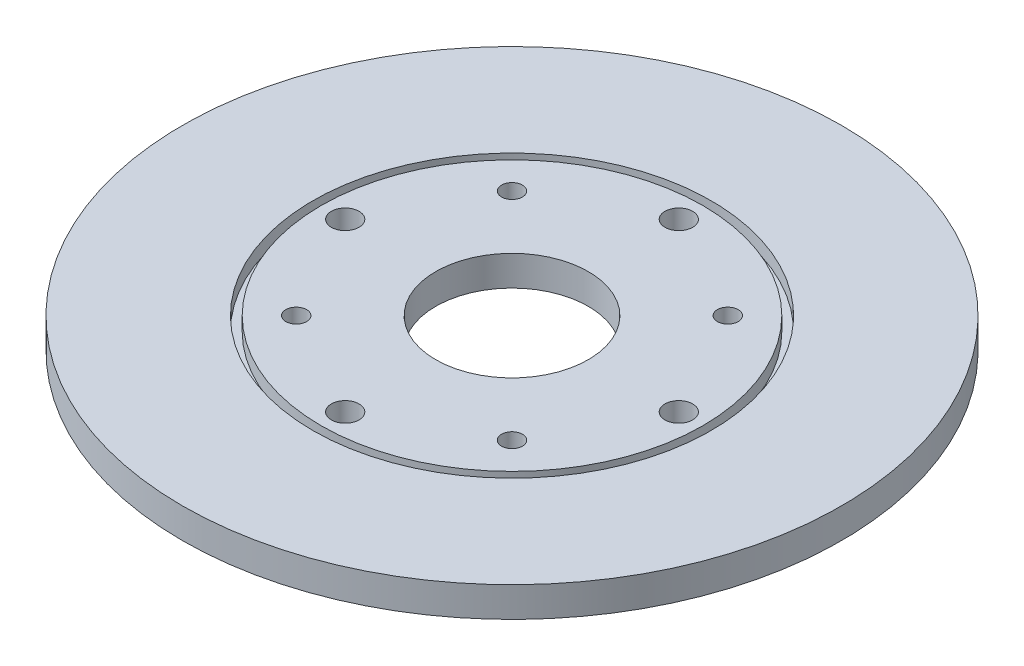
ISO-10303-21;
HEADER;
FILE_DESCRIPTION(('STEP AP214'),'2;1');
FILE_NAME('part.step','',(''),(''),'','','');
FILE_SCHEMA(('AUTOMOTIVE_DESIGN { 1 0 10303 214 1 1 1 1 }'));
ENDSEC;
DATA;
#1=APPLICATION_CONTEXT('core data for automotive mechanical design processes');
#2=APPLICATION_PROTOCOL_DEFINITION('international standard','automotive_design',2000,#1);
#3=PRODUCT_CONTEXT('',#1,'mechanical');
#4=PRODUCT('Part','Part','',(#3));
#5=PRODUCT_RELATED_PRODUCT_CATEGORY('part','',(#4));
#6=PRODUCT_DEFINITION_FORMATION('','',#4);
#7=PRODUCT_DEFINITION_CONTEXT('part definition',#1,'design');
#8=PRODUCT_DEFINITION('design','',#6,#7);
#9=PRODUCT_DEFINITION_SHAPE('','',#8);
#10=(LENGTH_UNIT() NAMED_UNIT(*) SI_UNIT(.MILLI.,.METRE.));
#11=(NAMED_UNIT(*) PLANE_ANGLE_UNIT() SI_UNIT($,.RADIAN.));
#12=(NAMED_UNIT(*) SI_UNIT($,.STERADIAN.) SOLID_ANGLE_UNIT());
#13=UNCERTAINTY_MEASURE_WITH_UNIT(LENGTH_MEASURE(1.E-05),#10,'distance_accuracy_value','');
#14=(GEOMETRIC_REPRESENTATION_CONTEXT(3) GLOBAL_UNCERTAINTY_ASSIGNED_CONTEXT((#13)) GLOBAL_UNIT_ASSIGNED_CONTEXT((#10,
#11,#12)) REPRESENTATION_CONTEXT('',''));
#15=CARTESIAN_POINT('',(0.,0.,0.));
#16=DIRECTION('',(0.,0.,1.));
#17=DIRECTION('',(1.,0.,0.));
#18=AXIS2_PLACEMENT_3D('',#15,#16,#17);
#19=CARTESIAN_POINT('',(0.,4.34,0.));
#20=DIRECTION('',(0.,1.,0.));
#21=DIRECTION('',(0.,0.,1.));
#22=AXIS2_PLACEMENT_3D('',#19,#20,#21);
#23=PLANE('',#22);
#24=CARTESIAN_POINT('',(0.,4.34,-24.0416305603426));
#25=DIRECTION('',(0.,1.,0.));
#26=DIRECTION('',(0.,0.,1.));
#27=AXIS2_PLACEMENT_3D('',#24,#25,#26);
#28=CIRCLE('',#27,2.);
#29=CARTESIAN_POINT('',(0.,4.34,-22.0416305603426));
#30=VERTEX_POINT('',#29);
#31=EDGE_CURVE('E106',#30,#30,#28,.T.);
#32=ORIENTED_EDGE('',*,*,#31,.F.);
#33=EDGE_LOOP('',(#32));
#34=FACE_BOUND('',#33,.T.);
#35=CARTESIAN_POINT('',(-24.0416305603426,4.34,0.));
#36=DIRECTION('',(0.,1.,0.));
#37=DIRECTION('',(0.,0.,1.));
#38=AXIS2_PLACEMENT_3D('',#35,#36,#37);
#39=CIRCLE('',#38,2.);
#40=CARTESIAN_POINT('',(-24.0416305603426,4.34,2.));
#41=VERTEX_POINT('',#40);
#42=EDGE_CURVE('E100',#41,#41,#39,.T.);
#43=ORIENTED_EDGE('',*,*,#42,.F.);
#44=EDGE_LOOP('',(#43));
#45=FACE_BOUND('',#44,.T.);
#46=CARTESIAN_POINT('',(0.,4.34,24.0416305603426));
#47=DIRECTION('',(0.,1.,0.));
#48=DIRECTION('',(0.,0.,1.));
#49=AXIS2_PLACEMENT_3D('',#46,#47,#48);
#50=CIRCLE('',#49,2.);
#51=CARTESIAN_POINT('',(0.,4.34,26.0416305603426));
#52=VERTEX_POINT('',#51);
#53=EDGE_CURVE('E94',#52,#52,#50,.T.);
#54=ORIENTED_EDGE('',*,*,#53,.F.);
#55=EDGE_LOOP('',(#54));
#56=FACE_BOUND('',#55,.T.);
#57=CARTESIAN_POINT('',(24.0416305603426,4.34,0.));
#58=DIRECTION('',(0.,1.,0.));
#59=DIRECTION('',(0.,0.,1.));
#60=AXIS2_PLACEMENT_3D('',#57,#58,#59);
#61=CIRCLE('',#60,2.);
#62=CARTESIAN_POINT('',(24.0416305603426,4.34,2.));
#63=VERTEX_POINT('',#62);
#64=EDGE_CURVE('E88',#63,#63,#61,.T.);
#65=ORIENTED_EDGE('',*,*,#64,.F.);
#66=EDGE_LOOP('',(#65));
#67=FACE_BOUND('',#66,.T.);
#68=CARTESIAN_POINT('',(-15.55,4.34,-15.55));
#69=DIRECTION('',(0.,1.,0.));
#70=DIRECTION('',(0.,0.,1.));
#71=AXIS2_PLACEMENT_3D('',#68,#69,#70);
#72=CIRCLE('',#71,1.5);
#73=CARTESIAN_POINT('',(-15.55,4.34,-14.05));
#74=VERTEX_POINT('',#73);
#75=EDGE_CURVE('E65',#74,#74,#72,.T.);
#76=ORIENTED_EDGE('',*,*,#75,.F.);
#77=EDGE_LOOP('',(#76));
#78=FACE_BOUND('',#77,.T.);
#79=CARTESIAN_POINT('',(15.55,4.34,15.55));
#80=DIRECTION('',(0.,1.,0.));
#81=DIRECTION('',(0.,0.,1.));
#82=AXIS2_PLACEMENT_3D('',#79,#80,#81);
#83=CIRCLE('',#82,1.5);
#84=CARTESIAN_POINT('',(15.55,4.34,17.05));
#85=VERTEX_POINT('',#84);
#86=EDGE_CURVE('E53',#85,#85,#83,.T.);
#87=ORIENTED_EDGE('',*,*,#86,.F.);
#88=EDGE_LOOP('',(#87));
#89=FACE_BOUND('',#88,.T.);
#90=CARTESIAN_POINT('',(0.,4.34,0.));
#91=DIRECTION('',(0.,1.,0.));
#92=DIRECTION('',(0.,0.,1.));
#93=AXIS2_PLACEMENT_3D('',#90,#91,#92);
#94=CIRCLE('',#93,11.);
#95=CARTESIAN_POINT('',(0.,4.34,11.));
#96=VERTEX_POINT('',#95);
#97=EDGE_CURVE('E42',#96,#96,#94,.T.);
#98=ORIENTED_EDGE('',*,*,#97,.F.);
#99=EDGE_LOOP('',(#98));
#100=FACE_BOUND('',#99,.T.);
#101=CARTESIAN_POINT('',(15.55,4.34,-15.55));
#102=DIRECTION('',(0.,1.,0.));
#103=DIRECTION('',(0.,0.,1.));
#104=AXIS2_PLACEMENT_3D('',#101,#102,#103);
#105=CIRCLE('',#104,1.5);
#106=CARTESIAN_POINT('',(15.55,4.34,-14.05));
#107=VERTEX_POINT('',#106);
#108=EDGE_CURVE('E47',#107,#107,#105,.T.);
#109=ORIENTED_EDGE('',*,*,#108,.F.);
#110=EDGE_LOOP('',(#109));
#111=FACE_BOUND('',#110,.T.);
#112=CARTESIAN_POINT('',(-15.55,4.34,15.55));
#113=DIRECTION('',(0.,1.,0.));
#114=DIRECTION('',(0.,0.,1.));
#115=AXIS2_PLACEMENT_3D('',#112,#113,#114);
#116=CIRCLE('',#115,1.5);
#117=CARTESIAN_POINT('',(-15.55,4.34,17.05));
#118=VERTEX_POINT('',#117);
#119=EDGE_CURVE('E59',#118,#118,#116,.T.);
#120=ORIENTED_EDGE('',*,*,#119,.F.);
#121=EDGE_LOOP('',(#120));
#122=FACE_BOUND('',#121,.T.);
#123=CARTESIAN_POINT('',(0.,4.34,0.));
#124=DIRECTION('',(0.,1.,0.));
#125=DIRECTION('',(0.,0.,1.));
#126=AXIS2_PLACEMENT_3D('',#123,#124,#125);
#127=CIRCLE('',#126,27.5);
#128=CARTESIAN_POINT('',(0.,4.34,27.5));
#129=VERTEX_POINT('',#128);
#130=EDGE_CURVE('E80',#129,#129,#127,.T.);
#131=ORIENTED_EDGE('',*,*,#130,.T.);
#132=EDGE_LOOP('',(#131));
#133=FACE_BOUND('',#132,.T.);
#134=ADVANCED_FACE('F31',(#34,#45,#56,#67,#78,#89,#100,#111,#122,#133),#23,.T.);
#135=CARTESIAN_POINT('',(0.,4.34,0.));
#136=DIRECTION('',(0.,1.,0.));
#137=DIRECTION('',(0.,0.,1.));
#138=AXIS2_PLACEMENT_3D('',#135,#136,#137);
#139=CIRCLE('',#138,28.7);
#140=CARTESIAN_POINT('',(0.,4.34,28.7));
#141=VERTEX_POINT('',#140);
#142=EDGE_CURVE('E74',#141,#141,#139,.T.);
#143=ORIENTED_EDGE('',*,*,#142,.F.);
#144=EDGE_LOOP('',(#143));
#145=FACE_BOUND('',#144,.T.);
#146=CARTESIAN_POINT('',(0.,4.34,0.));
#147=DIRECTION('',(0.,1.,0.));
#148=DIRECTION('',(0.,0.,1.));
#149=AXIS2_PLACEMENT_3D('',#146,#147,#148);
#150=CIRCLE('',#149,47.5);
#151=CARTESIAN_POINT('',(0.,4.34,47.5));
#152=VERTEX_POINT('',#151);
#153=EDGE_CURVE('E10',#152,#152,#150,.T.);
#154=ORIENTED_EDGE('',*,*,#153,.T.);
#155=EDGE_LOOP('',(#154));
#156=FACE_BOUND('',#155,.T.);
#157=ADVANCED_FACE('F115',(#145,#156),#23,.T.);
#158=CARTESIAN_POINT('',(0.,0.,0.));
#159=DIRECTION('',(0.,1.,0.));
#160=DIRECTION('',(0.,0.,1.));
#161=AXIS2_PLACEMENT_3D('',#158,#159,#160);
#162=PLANE('',#161);
#163=CARTESIAN_POINT('',(0.,0.,-24.0416305603426));
#164=DIRECTION('',(0.,1.,0.));
#165=DIRECTION('',(0.,0.,1.));
#166=AXIS2_PLACEMENT_3D('',#163,#164,#165);
#167=CIRCLE('',#166,2.);
#168=CARTESIAN_POINT('',(0.,0.,-22.0416305603426));
#169=VERTEX_POINT('',#168);
#170=EDGE_CURVE('E103',#169,#169,#167,.F.);
#171=ORIENTED_EDGE('',*,*,#170,.F.);
#172=EDGE_LOOP('',(#171));
#173=FACE_BOUND('',#172,.T.);
#174=CARTESIAN_POINT('',(-24.0416305603426,0.,0.));
#175=DIRECTION('',(0.,1.,0.));
#176=DIRECTION('',(0.,0.,1.));
#177=AXIS2_PLACEMENT_3D('',#174,#175,#176);
#178=CIRCLE('',#177,2.);
#179=CARTESIAN_POINT('',(-24.0416305603426,0.,2.));
#180=VERTEX_POINT('',#179);
#181=EDGE_CURVE('E97',#180,#180,#178,.F.);
#182=ORIENTED_EDGE('',*,*,#181,.F.);
#183=EDGE_LOOP('',(#182));
#184=FACE_BOUND('',#183,.T.);
#185=CARTESIAN_POINT('',(0.,0.,24.0416305603426));
#186=DIRECTION('',(0.,1.,0.));
#187=DIRECTION('',(0.,0.,1.));
#188=AXIS2_PLACEMENT_3D('',#185,#186,#187);
#189=CIRCLE('',#188,2.);
#190=CARTESIAN_POINT('',(0.,0.,26.0416305603426));
#191=VERTEX_POINT('',#190);
#192=EDGE_CURVE('E91',#191,#191,#189,.F.);
#193=ORIENTED_EDGE('',*,*,#192,.F.);
#194=EDGE_LOOP('',(#193));
#195=FACE_BOUND('',#194,.T.);
#196=CARTESIAN_POINT('',(24.0416305603426,0.,0.));
#197=DIRECTION('',(0.,1.,0.));
#198=DIRECTION('',(0.,0.,1.));
#199=AXIS2_PLACEMENT_3D('',#196,#197,#198);
#200=CIRCLE('',#199,2.);
#201=CARTESIAN_POINT('',(24.0416305603426,0.,2.));
#202=VERTEX_POINT('',#201);
#203=EDGE_CURVE('E83',#202,#202,#200,.F.);
#204=ORIENTED_EDGE('',*,*,#203,.F.);
#205=EDGE_LOOP('',(#204));
#206=FACE_BOUND('',#205,.T.);
#207=CARTESIAN_POINT('',(-15.55,0.,15.55));
#208=DIRECTION('',(0.,1.,0.));
#209=DIRECTION('',(0.,0.,1.));
#210=AXIS2_PLACEMENT_3D('',#207,#208,#209);
#211=CIRCLE('',#210,1.5);
#212=CARTESIAN_POINT('',(-15.55,0.,17.05));
#213=VERTEX_POINT('',#212);
#214=EDGE_CURVE('E62',#213,#213,#211,.T.);
#215=ORIENTED_EDGE('',*,*,#214,.T.);
#216=EDGE_LOOP('',(#215));
#217=FACE_BOUND('',#216,.T.);
#218=CARTESIAN_POINT('',(15.55,0.,-15.55));
#219=DIRECTION('',(0.,1.,0.));
#220=DIRECTION('',(0.,0.,1.));
#221=AXIS2_PLACEMENT_3D('',#218,#219,#220);
#222=CIRCLE('',#221,1.5);
#223=CARTESIAN_POINT('',(15.55,0.,-14.05));
#224=VERTEX_POINT('',#223);
#225=EDGE_CURVE('E50',#224,#224,#222,.T.);
#226=ORIENTED_EDGE('',*,*,#225,.T.);
#227=EDGE_LOOP('',(#226));
#228=FACE_BOUND('',#227,.T.);
#229=CARTESIAN_POINT('',(0.,0.,0.));
#230=DIRECTION('',(0.,1.,0.));
#231=DIRECTION('',(0.,0.,1.));
#232=AXIS2_PLACEMENT_3D('',#229,#230,#231);
#233=CIRCLE('',#232,47.5);
#234=CARTESIAN_POINT('',(0.,0.,47.5));
#235=VERTEX_POINT('',#234);
#236=EDGE_CURVE('E35',#235,#235,#233,.T.);
#237=ORIENTED_EDGE('',*,*,#236,.F.);
#238=EDGE_LOOP('',(#237));
#239=FACE_BOUND('',#238,.T.);
#240=CARTESIAN_POINT('',(0.,0.,0.));
#241=DIRECTION('',(0.,1.,0.));
#242=DIRECTION('',(0.,0.,1.));
#243=AXIS2_PLACEMENT_3D('',#240,#241,#242);
#244=CIRCLE('',#243,11.);
#245=CARTESIAN_POINT('',(0.,0.,11.));
#246=VERTEX_POINT('',#245);
#247=EDGE_CURVE('E44',#246,#246,#244,.T.);
#248=ORIENTED_EDGE('',*,*,#247,.T.);
#249=EDGE_LOOP('',(#248));
#250=FACE_BOUND('',#249,.T.);
#251=CARTESIAN_POINT('',(15.55,0.,15.55));
#252=DIRECTION('',(0.,1.,0.));
#253=DIRECTION('',(0.,0.,1.));
#254=AXIS2_PLACEMENT_3D('',#251,#252,#253);
#255=CIRCLE('',#254,1.5);
#256=CARTESIAN_POINT('',(15.55,0.,17.05));
#257=VERTEX_POINT('',#256);
#258=EDGE_CURVE('E56',#257,#257,#255,.T.);
#259=ORIENTED_EDGE('',*,*,#258,.T.);
#260=EDGE_LOOP('',(#259));
#261=FACE_BOUND('',#260,.T.);
#262=CARTESIAN_POINT('',(-15.55,0.,-15.55));
#263=DIRECTION('',(0.,1.,0.));
#264=DIRECTION('',(0.,0.,1.));
#265=AXIS2_PLACEMENT_3D('',#262,#263,#264);
#266=CIRCLE('',#265,1.5);
#267=CARTESIAN_POINT('',(-15.55,0.,-14.05));
#268=VERTEX_POINT('',#267);
#269=EDGE_CURVE('E68',#268,#268,#266,.T.);
#270=ORIENTED_EDGE('',*,*,#269,.T.);
#271=EDGE_LOOP('',(#270));
#272=FACE_BOUND('',#271,.T.);
#273=ADVANCED_FACE('F176',(#173,#184,#195,#206,#217,#228,#239,#250,#261,#272),#162,.F.);
#274=CARTESIAN_POINT('',(0.,4.34,0.));
#275=DIRECTION('',(0.,-1.,0.));
#276=DIRECTION('',(0.,0.,-1.));
#277=AXIS2_PLACEMENT_3D('',#274,#275,#276);
#278=CYLINDRICAL_SURFACE('',#277,47.5);
#279=ORIENTED_EDGE('',*,*,#153,.F.);
#280=EDGE_LOOP('',(#279));
#281=FACE_BOUND('',#280,.T.);
#282=ORIENTED_EDGE('',*,*,#236,.T.);
#283=EDGE_LOOP('',(#282));
#284=FACE_BOUND('',#283,.T.);
#285=ADVANCED_FACE('F33',(#281,#284),#278,.T.);
#286=CARTESIAN_POINT('',(0.,4.34,0.));
#287=DIRECTION('',(0.,-1.,0.));
#288=DIRECTION('',(0.,0.,-1.));
#289=AXIS2_PLACEMENT_3D('',#286,#287,#288);
#290=CYLINDRICAL_SURFACE('',#289,11.);
#291=ORIENTED_EDGE('',*,*,#97,.T.);
#292=EDGE_LOOP('',(#291));
#293=FACE_BOUND('',#292,.T.);
#294=ORIENTED_EDGE('',*,*,#247,.F.);
#295=EDGE_LOOP('',(#294));
#296=FACE_BOUND('',#295,.T.);
#297=ADVANCED_FACE('F171',(#293,#296),#290,.F.);
#298=CARTESIAN_POINT('',(15.55,4.34,-15.55));
#299=DIRECTION('',(0.,-1.,0.));
#300=DIRECTION('',(0.,0.,-1.));
#301=AXIS2_PLACEMENT_3D('',#298,#299,#300);
#302=CYLINDRICAL_SURFACE('',#301,1.5);
#303=ORIENTED_EDGE('',*,*,#108,.T.);
#304=EDGE_LOOP('',(#303));
#305=FACE_BOUND('',#304,.T.);
#306=ORIENTED_EDGE('',*,*,#225,.F.);
#307=EDGE_LOOP('',(#306));
#308=FACE_BOUND('',#307,.T.);
#309=ADVANCED_FACE('F167',(#305,#308),#302,.F.);
#310=CARTESIAN_POINT('',(15.55,4.34,15.55));
#311=DIRECTION('',(0.,-1.,0.));
#312=DIRECTION('',(0.,0.,-1.));
#313=AXIS2_PLACEMENT_3D('',#310,#311,#312);
#314=CYLINDRICAL_SURFACE('',#313,1.5);
#315=ORIENTED_EDGE('',*,*,#86,.T.);
#316=EDGE_LOOP('',(#315));
#317=FACE_BOUND('',#316,.T.);
#318=ORIENTED_EDGE('',*,*,#258,.F.);
#319=EDGE_LOOP('',(#318));
#320=FACE_BOUND('',#319,.T.);
#321=ADVANCED_FACE('F163',(#317,#320),#314,.F.);
#322=CARTESIAN_POINT('',(-15.55,4.34,15.55));
#323=DIRECTION('',(0.,-1.,0.));
#324=DIRECTION('',(0.,0.,-1.));
#325=AXIS2_PLACEMENT_3D('',#322,#323,#324);
#326=CYLINDRICAL_SURFACE('',#325,1.5);
#327=ORIENTED_EDGE('',*,*,#119,.T.);
#328=EDGE_LOOP('',(#327));
#329=FACE_BOUND('',#328,.T.);
#330=ORIENTED_EDGE('',*,*,#214,.F.);
#331=EDGE_LOOP('',(#330));
#332=FACE_BOUND('',#331,.T.);
#333=ADVANCED_FACE('F159',(#329,#332),#326,.F.);
#334=CARTESIAN_POINT('',(-15.55,4.34,-15.55));
#335=DIRECTION('',(0.,-1.,0.));
#336=DIRECTION('',(0.,0.,-1.));
#337=AXIS2_PLACEMENT_3D('',#334,#335,#336);
#338=CYLINDRICAL_SURFACE('',#337,1.5);
#339=ORIENTED_EDGE('',*,*,#75,.T.);
#340=EDGE_LOOP('',(#339));
#341=FACE_BOUND('',#340,.T.);
#342=ORIENTED_EDGE('',*,*,#269,.F.);
#343=EDGE_LOOP('',(#342));
#344=FACE_BOUND('',#343,.T.);
#345=ADVANCED_FACE('F155',(#341,#344),#338,.F.);
#346=CARTESIAN_POINT('',(0.,2.34,0.));
#347=DIRECTION('',(0.,1.,0.));
#348=DIRECTION('',(0.,0.,1.));
#349=AXIS2_PLACEMENT_3D('',#346,#347,#348);
#350=CYLINDRICAL_SURFACE('',#349,28.7);
#351=CARTESIAN_POINT('',(0.,2.34,0.));
#352=DIRECTION('',(0.,1.,0.));
#353=DIRECTION('',(0.,0.,1.));
#354=AXIS2_PLACEMENT_3D('',#351,#352,#353);
#355=CIRCLE('',#354,28.7);
#356=CARTESIAN_POINT('',(0.,2.34,28.7));
#357=VERTEX_POINT('',#356);
#358=EDGE_CURVE('E71',#357,#357,#355,.T.);
#359=ORIENTED_EDGE('',*,*,#358,.F.);
#360=EDGE_LOOP('',(#359));
#361=FACE_BOUND('',#360,.T.);
#362=ORIENTED_EDGE('',*,*,#142,.T.);
#363=EDGE_LOOP('',(#362));
#364=FACE_BOUND('',#363,.T.);
#365=ADVANCED_FACE('F148',(#361,#364),#350,.F.);
#366=CARTESIAN_POINT('',(0.,2.34,0.));
#367=DIRECTION('',(0.,1.,0.));
#368=DIRECTION('',(0.,0.,1.));
#369=AXIS2_PLACEMENT_3D('',#366,#367,#368);
#370=PLANE('',#369);
#371=CARTESIAN_POINT('',(0.,2.34,0.));
#372=DIRECTION('',(0.,1.,0.));
#373=DIRECTION('',(0.,0.,1.));
#374=AXIS2_PLACEMENT_3D('',#371,#372,#373);
#375=CIRCLE('',#374,27.5);
#376=CARTESIAN_POINT('',(0.,2.34,27.5));
#377=VERTEX_POINT('',#376);
#378=EDGE_CURVE('E77',#377,#377,#375,.T.);
#379=ORIENTED_EDGE('',*,*,#378,.F.);
#380=EDGE_LOOP('',(#379));
#381=FACE_BOUND('',#380,.T.);
#382=ORIENTED_EDGE('',*,*,#358,.T.);
#383=EDGE_LOOP('',(#382));
#384=FACE_BOUND('',#383,.T.);
#385=ADVANCED_FACE('F138',(#381,#384),#370,.T.);
#386=CARTESIAN_POINT('',(0.,2.34,0.));
#387=DIRECTION('',(0.,1.,0.));
#388=DIRECTION('',(0.,0.,1.));
#389=AXIS2_PLACEMENT_3D('',#386,#387,#388);
#390=CYLINDRICAL_SURFACE('',#389,27.5);
#391=ORIENTED_EDGE('',*,*,#378,.T.);
#392=EDGE_LOOP('',(#391));
#393=FACE_BOUND('',#392,.T.);
#394=ORIENTED_EDGE('',*,*,#130,.F.);
#395=EDGE_LOOP('',(#394));
#396=FACE_BOUND('',#395,.T.);
#397=ADVANCED_FACE('F135',(#393,#396),#390,.T.);
#398=CARTESIAN_POINT('',(24.0416305603426,-0.00100000000000013,0.));
#399=DIRECTION('',(0.,1.,0.));
#400=DIRECTION('',(0.,0.,1.));
#401=AXIS2_PLACEMENT_3D('',#398,#399,#400);
#402=CYLINDRICAL_SURFACE('',#401,2.);
#403=ORIENTED_EDGE('',*,*,#64,.T.);
#404=EDGE_LOOP('',(#403));
#405=FACE_BOUND('',#404,.T.);
#406=ORIENTED_EDGE('',*,*,#203,.T.);
#407=EDGE_LOOP('',(#406));
#408=FACE_BOUND('',#407,.T.);
#409=ADVANCED_FACE('F137',(#405,#408),#402,.F.);
#410=CARTESIAN_POINT('',(0.,-0.00100000000000013,24.0416305603426));
#411=DIRECTION('',(0.,1.,0.));
#412=DIRECTION('',(0.,0.,1.));
#413=AXIS2_PLACEMENT_3D('',#410,#411,#412);
#414=CYLINDRICAL_SURFACE('',#413,2.);
#415=ORIENTED_EDGE('',*,*,#53,.T.);
#416=EDGE_LOOP('',(#415));
#417=FACE_BOUND('',#416,.T.);
#418=ORIENTED_EDGE('',*,*,#192,.T.);
#419=EDGE_LOOP('',(#418));
#420=FACE_BOUND('',#419,.T.);
#421=ADVANCED_FACE('F145',(#417,#420),#414,.F.);
#422=CARTESIAN_POINT('',(-24.0416305603426,-0.00100000000000013,0.));
#423=DIRECTION('',(0.,1.,0.));
#424=DIRECTION('',(0.,0.,1.));
#425=AXIS2_PLACEMENT_3D('',#422,#423,#424);
#426=CYLINDRICAL_SURFACE('',#425,2.);
#427=ORIENTED_EDGE('',*,*,#42,.T.);
#428=EDGE_LOOP('',(#427));
#429=FACE_BOUND('',#428,.T.);
#430=ORIENTED_EDGE('',*,*,#181,.T.);
#431=EDGE_LOOP('',(#430));
#432=FACE_BOUND('',#431,.T.);
#433=ADVANCED_FACE('F212',(#429,#432),#426,.F.);
#434=CARTESIAN_POINT('',(0.,-0.00100000000000013,-24.0416305603426));
#435=DIRECTION('',(0.,1.,0.));
#436=DIRECTION('',(0.,0.,1.));
#437=AXIS2_PLACEMENT_3D('',#434,#435,#436);
#438=CYLINDRICAL_SURFACE('',#437,2.);
#439=ORIENTED_EDGE('',*,*,#31,.T.);
#440=EDGE_LOOP('',(#439));
#441=FACE_BOUND('',#440,.T.);
#442=ORIENTED_EDGE('',*,*,#170,.T.);
#443=EDGE_LOOP('',(#442));
#444=FACE_BOUND('',#443,.T.);
#445=ADVANCED_FACE('F110',(#441,#444),#438,.F.);
#446=CLOSED_SHELL('',(#134,#157,#273,#285,#297,#309,#321,#333,#345,#365,#385,#397,#409,#421,
#433,#445));
#447=MANIFOLD_SOLID_BREP('B2',#446);
#448=ADVANCED_BREP_SHAPE_REPRESENTATION('',(#18,#447),#14);
#449=SHAPE_DEFINITION_REPRESENTATION(#9,#448);
ENDSEC;
END-ISO-10303-21;
